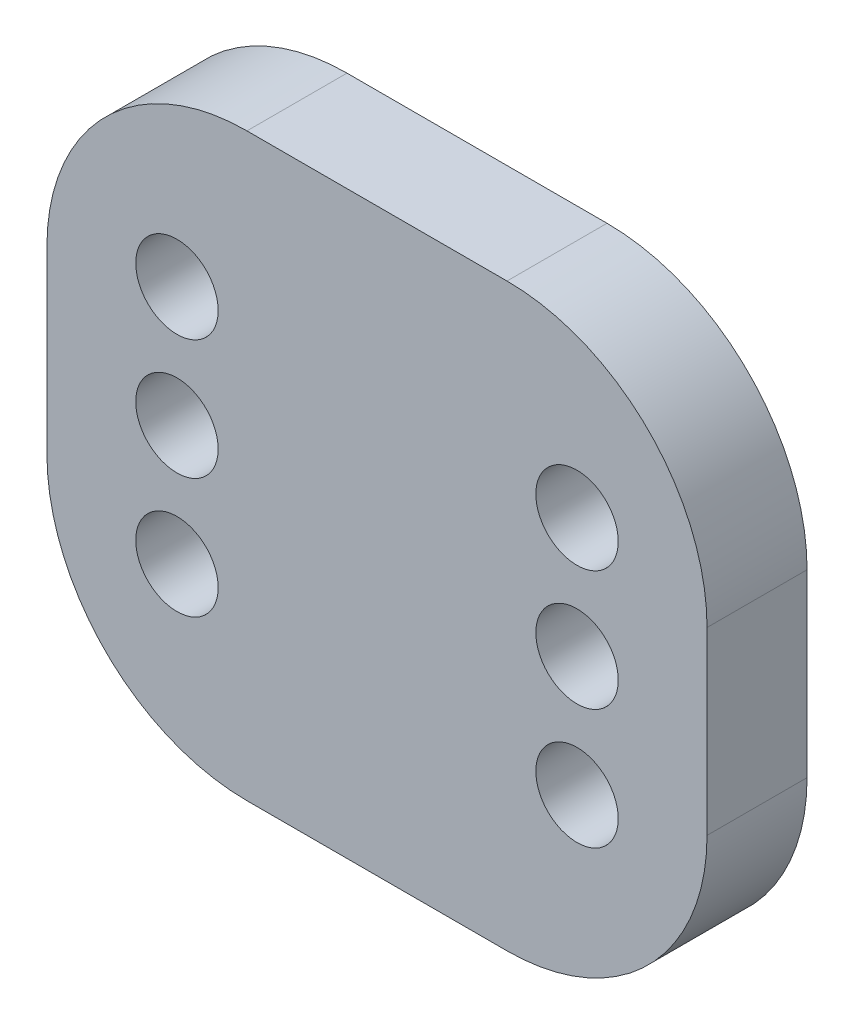
ISO-10303-21;
HEADER;
FILE_DESCRIPTION(('STEP AP214'),'2;1');
FILE_NAME('part.step','',(''),(''),'','','');
FILE_SCHEMA(('AUTOMOTIVE_DESIGN { 1 0 10303 214 1 1 1 1 }'));
ENDSEC;
DATA;
#1=APPLICATION_CONTEXT('core data for automotive mechanical design processes');
#2=APPLICATION_PROTOCOL_DEFINITION('international standard','automotive_design',2000,#1);
#3=PRODUCT_CONTEXT('',#1,'mechanical');
#4=PRODUCT('Part','Part','',(#3));
#5=PRODUCT_RELATED_PRODUCT_CATEGORY('part','',(#4));
#6=PRODUCT_DEFINITION_FORMATION('','',#4);
#7=PRODUCT_DEFINITION_CONTEXT('part definition',#1,'design');
#8=PRODUCT_DEFINITION('design','',#6,#7);
#9=PRODUCT_DEFINITION_SHAPE('','',#8);
#10=(LENGTH_UNIT() NAMED_UNIT(*) SI_UNIT(.MILLI.,.METRE.));
#11=(NAMED_UNIT(*) PLANE_ANGLE_UNIT() SI_UNIT($,.RADIAN.));
#12=(NAMED_UNIT(*) SI_UNIT($,.STERADIAN.) SOLID_ANGLE_UNIT());
#13=UNCERTAINTY_MEASURE_WITH_UNIT(LENGTH_MEASURE(1.E-05),#10,'distance_accuracy_value','');
#14=(GEOMETRIC_REPRESENTATION_CONTEXT(3) GLOBAL_UNCERTAINTY_ASSIGNED_CONTEXT((#13)) GLOBAL_UNIT_ASSIGNED_CONTEXT((#10,
#11,#12)) REPRESENTATION_CONTEXT('',''));
#15=CARTESIAN_POINT('',(0.,0.,0.));
#16=DIRECTION('',(0.,0.,1.));
#17=DIRECTION('',(1.,0.,0.));
#18=AXIS2_PLACEMENT_3D('',#15,#16,#17);
#19=CARTESIAN_POINT('',(0.,0.,6.35));
#20=DIRECTION('',(0.,0.,1.));
#21=DIRECTION('',(1.,0.,0.));
#22=AXIS2_PLACEMENT_3D('',#19,#20,#21);
#23=PLANE('',#22);
#24=CARTESIAN_POINT('',(-12.7,-7.62,6.35));
#25=DIRECTION('',(0.,0.,1.));
#26=DIRECTION('',(1.,0.,0.));
#27=AXIS2_PLACEMENT_3D('',#24,#25,#26);
#28=CIRCLE('',#27,2.6162);
#29=CARTESIAN_POINT('',(-10.0838,-7.62,6.35));
#30=VERTEX_POINT('',#29);
#31=EDGE_CURVE('E201',#30,#30,#28,.T.);
#32=ORIENTED_EDGE('',*,*,#31,.F.);
#33=EDGE_LOOP('',(#32));
#34=FACE_BOUND('',#33,.T.);
#35=CARTESIAN_POINT('',(-12.7,7.62,6.35));
#36=DIRECTION('',(0.,0.,1.));
#37=DIRECTION('',(1.,0.,0.));
#38=AXIS2_PLACEMENT_3D('',#35,#36,#37);
#39=CIRCLE('',#38,2.6162);
#40=CARTESIAN_POINT('',(-10.0838,7.62,6.35));
#41=VERTEX_POINT('',#40);
#42=EDGE_CURVE('E189',#41,#41,#39,.T.);
#43=ORIENTED_EDGE('',*,*,#42,.F.);
#44=EDGE_LOOP('',(#43));
#45=FACE_BOUND('',#44,.T.);
#46=CARTESIAN_POINT('',(-12.7,0.,6.35));
#47=DIRECTION('',(0.,0.,1.));
#48=DIRECTION('',(1.,0.,0.));
#49=AXIS2_PLACEMENT_3D('',#46,#47,#48);
#50=CIRCLE('',#49,2.6162);
#51=CARTESIAN_POINT('',(-10.0838,0.,6.35));
#52=VERTEX_POINT('',#51);
#53=EDGE_CURVE('E172',#52,#52,#50,.T.);
#54=ORIENTED_EDGE('',*,*,#53,.F.);
#55=EDGE_LOOP('',(#54));
#56=FACE_BOUND('',#55,.T.);
#57=DIRECTION('',(0.,-1.,0.));
#58=VECTOR('',#57,1.);
#59=CARTESIAN_POINT('',(-20.955,18.415,6.35));
#60=LINE('',#59,#58);
#61=CARTESIAN_POINT('',(-20.955,5.715,6.35));
#62=VERTEX_POINT('',#61);
#63=CARTESIAN_POINT('',(-20.955,-5.715,6.35));
#64=VERTEX_POINT('',#63);
#65=EDGE_CURVE('E179',#62,#64,#60,.T.);
#66=ORIENTED_EDGE('',*,*,#65,.T.);
#67=CARTESIAN_POINT('',(-8.255,-5.715,6.35));
#68=DIRECTION('',(0.,0.,1.));
#69=DIRECTION('',(1.,0.,0.));
#70=AXIS2_PLACEMENT_3D('',#67,#68,#69);
#71=CIRCLE('',#70,12.7);
#72=CARTESIAN_POINT('',(-8.255,-18.415,6.35));
#73=VERTEX_POINT('',#72);
#74=EDGE_CURVE('E156',#64,#73,#71,.T.);
#75=ORIENTED_EDGE('',*,*,#74,.T.);
#76=DIRECTION('',(1.,0.,0.));
#77=VECTOR('',#76,1.);
#78=CARTESIAN_POINT('',(-20.955,-18.415,6.35));
#79=LINE('',#78,#77);
#80=CARTESIAN_POINT('',(8.25500000000001,-18.415,6.35));
#81=VERTEX_POINT('',#80);
#82=EDGE_CURVE('E127',#73,#81,#79,.T.);
#83=ORIENTED_EDGE('',*,*,#82,.T.);
#84=CARTESIAN_POINT('',(8.25500000000001,-5.715,6.35));
#85=DIRECTION('',(0.,0.,1.));
#86=DIRECTION('',(1.,0.,0.));
#87=AXIS2_PLACEMENT_3D('',#84,#85,#86);
#88=CIRCLE('',#87,12.7);
#89=CARTESIAN_POINT('',(20.955,-5.71499999999999,6.35));
#90=VERTEX_POINT('',#89);
#91=EDGE_CURVE('E154',#81,#90,#88,.T.);
#92=ORIENTED_EDGE('',*,*,#91,.T.);
#93=DIRECTION('',(0.,1.,0.));
#94=VECTOR('',#93,1.);
#95=CARTESIAN_POINT('',(20.955,18.415,6.35));
#96=LINE('',#95,#94);
#97=CARTESIAN_POINT('',(20.955,5.715,6.35));
#98=VERTEX_POINT('',#97);
#99=EDGE_CURVE('E134',#90,#98,#96,.T.);
#100=ORIENTED_EDGE('',*,*,#99,.T.);
#101=CARTESIAN_POINT('',(8.25500000000001,5.715,6.35));
#102=DIRECTION('',(0.,0.,1.));
#103=DIRECTION('',(1.,0.,0.));
#104=AXIS2_PLACEMENT_3D('',#101,#102,#103);
#105=CIRCLE('',#104,12.7);
#106=CARTESIAN_POINT('',(8.25500000000001,18.415,6.35));
#107=VERTEX_POINT('',#106);
#108=EDGE_CURVE('E62',#98,#107,#105,.T.);
#109=ORIENTED_EDGE('',*,*,#108,.T.);
#110=DIRECTION('',(-1.,0.,0.));
#111=VECTOR('',#110,1.);
#112=CARTESIAN_POINT('',(-20.955,18.415,6.35));
#113=LINE('',#112,#111);
#114=CARTESIAN_POINT('',(-8.255,18.415,6.35));
#115=VERTEX_POINT('',#114);
#116=EDGE_CURVE('E137',#107,#115,#113,.T.);
#117=ORIENTED_EDGE('',*,*,#116,.T.);
#118=CARTESIAN_POINT('',(-8.255,5.715,6.35));
#119=DIRECTION('',(0.,0.,1.));
#120=DIRECTION('',(1.,0.,0.));
#121=AXIS2_PLACEMENT_3D('',#118,#119,#120);
#122=CIRCLE('',#121,12.7);
#123=EDGE_CURVE('E151',#115,#62,#122,.T.);
#124=ORIENTED_EDGE('',*,*,#123,.T.);
#125=EDGE_LOOP('',(#66,#75,#83,#92,#100,#109,#117,#124));
#126=FACE_BOUND('',#125,.T.);
#127=CARTESIAN_POINT('',(12.7,0.,6.35));
#128=DIRECTION('',(0.,0.,1.));
#129=DIRECTION('',(1.,0.,0.));
#130=AXIS2_PLACEMENT_3D('',#127,#128,#129);
#131=CIRCLE('',#130,2.6162);
#132=CARTESIAN_POINT('',(15.3162,0.,6.35));
#133=VERTEX_POINT('',#132);
#134=EDGE_CURVE('E184',#133,#133,#131,.T.);
#135=ORIENTED_EDGE('',*,*,#134,.F.);
#136=EDGE_LOOP('',(#135));
#137=FACE_BOUND('',#136,.T.);
#138=CARTESIAN_POINT('',(12.7,7.62,6.35));
#139=DIRECTION('',(0.,0.,1.));
#140=DIRECTION('',(1.,0.,0.));
#141=AXIS2_PLACEMENT_3D('',#138,#139,#140);
#142=CIRCLE('',#141,2.6162);
#143=CARTESIAN_POINT('',(15.3162,7.62,6.35));
#144=VERTEX_POINT('',#143);
#145=EDGE_CURVE('E195',#144,#144,#142,.T.);
#146=ORIENTED_EDGE('',*,*,#145,.F.);
#147=EDGE_LOOP('',(#146));
#148=FACE_BOUND('',#147,.T.);
#149=CARTESIAN_POINT('',(12.7,-7.62,6.35));
#150=DIRECTION('',(0.,0.,1.));
#151=DIRECTION('',(1.,0.,0.));
#152=AXIS2_PLACEMENT_3D('',#149,#150,#151);
#153=CIRCLE('',#152,2.6162);
#154=CARTESIAN_POINT('',(15.3162,-7.62,6.35));
#155=VERTEX_POINT('',#154);
#156=EDGE_CURVE('E207',#155,#155,#153,.T.);
#157=ORIENTED_EDGE('',*,*,#156,.F.);
#158=EDGE_LOOP('',(#157));
#159=FACE_BOUND('',#158,.T.);
#160=ADVANCED_FACE('F41',(#34,#45,#56,#126,#137,#148,#159),#23,.T.);
#161=CARTESIAN_POINT('',(0.,0.,0.));
#162=DIRECTION('',(0.,0.,1.));
#163=DIRECTION('',(1.,0.,0.));
#164=AXIS2_PLACEMENT_3D('',#161,#162,#163);
#165=PLANE('',#164);
#166=DIRECTION('',(1.,0.,0.));
#167=VECTOR('',#166,1.);
#168=CARTESIAN_POINT('',(-20.955,-18.415,0.));
#169=LINE('',#168,#167);
#170=CARTESIAN_POINT('',(-8.255,-18.415,0.));
#171=VERTEX_POINT('',#170);
#172=CARTESIAN_POINT('',(8.25500000000001,-18.415,0.));
#173=VERTEX_POINT('',#172);
#174=EDGE_CURVE('E124',#171,#173,#169,.T.);
#175=ORIENTED_EDGE('',*,*,#174,.F.);
#176=CARTESIAN_POINT('',(-8.255,-5.715,0.));
#177=DIRECTION('',(0.,0.,1.));
#178=DIRECTION('',(1.,0.,0.));
#179=AXIS2_PLACEMENT_3D('',#176,#177,#178);
#180=CIRCLE('',#179,12.7);
#181=CARTESIAN_POINT('',(-20.955,-5.715,0.));
#182=VERTEX_POINT('',#181);
#183=EDGE_CURVE('E107',#171,#182,#180,.F.);
#184=ORIENTED_EDGE('',*,*,#183,.T.);
#185=DIRECTION('',(0.,-1.,0.));
#186=VECTOR('',#185,1.);
#187=CARTESIAN_POINT('',(-20.955,18.415,0.));
#188=LINE('',#187,#186);
#189=CARTESIAN_POINT('',(-20.955,5.715,0.));
#190=VERTEX_POINT('',#189);
#191=EDGE_CURVE('E135',#190,#182,#188,.T.);
#192=ORIENTED_EDGE('',*,*,#191,.F.);
#193=CARTESIAN_POINT('',(-8.255,5.715,0.));
#194=DIRECTION('',(0.,0.,1.));
#195=DIRECTION('',(1.,0.,0.));
#196=AXIS2_PLACEMENT_3D('',#193,#194,#195);
#197=CIRCLE('',#196,12.7);
#198=CARTESIAN_POINT('',(-8.255,18.415,0.));
#199=VERTEX_POINT('',#198);
#200=EDGE_CURVE('E128',#190,#199,#197,.F.);
#201=ORIENTED_EDGE('',*,*,#200,.T.);
#202=DIRECTION('',(-1.,0.,0.));
#203=VECTOR('',#202,1.);
#204=CARTESIAN_POINT('',(-20.955,18.415,0.));
#205=LINE('',#204,#203);
#206=CARTESIAN_POINT('',(8.25500000000001,18.415,0.));
#207=VERTEX_POINT('',#206);
#208=EDGE_CURVE('E139',#207,#199,#205,.T.);
#209=ORIENTED_EDGE('',*,*,#208,.F.);
#210=CARTESIAN_POINT('',(8.25500000000001,5.715,0.));
#211=DIRECTION('',(0.,0.,1.));
#212=DIRECTION('',(1.,0.,0.));
#213=AXIS2_PLACEMENT_3D('',#210,#211,#212);
#214=CIRCLE('',#213,12.7);
#215=CARTESIAN_POINT('',(20.955,5.715,0.));
#216=VERTEX_POINT('',#215);
#217=EDGE_CURVE('E145',#207,#216,#214,.F.);
#218=ORIENTED_EDGE('',*,*,#217,.T.);
#219=DIRECTION('',(0.,1.,0.));
#220=VECTOR('',#219,1.);
#221=CARTESIAN_POINT('',(20.955,18.415,0.));
#222=LINE('',#221,#220);
#223=CARTESIAN_POINT('',(20.955,-5.71499999999999,0.));
#224=VERTEX_POINT('',#223);
#225=EDGE_CURVE('E167',#224,#216,#222,.T.);
#226=ORIENTED_EDGE('',*,*,#225,.F.);
#227=CARTESIAN_POINT('',(8.25500000000001,-5.715,0.));
#228=DIRECTION('',(0.,0.,1.));
#229=DIRECTION('',(1.,0.,0.));
#230=AXIS2_PLACEMENT_3D('',#227,#228,#229);
#231=CIRCLE('',#230,12.7);
#232=EDGE_CURVE('E118',#224,#173,#231,.F.);
#233=ORIENTED_EDGE('',*,*,#232,.T.);
#234=EDGE_LOOP('',(#175,#184,#192,#201,#209,#218,#226,#233));
#235=FACE_BOUND('',#234,.T.);
#236=CARTESIAN_POINT('',(-12.7,0.,0.));
#237=DIRECTION('',(0.,0.,1.));
#238=DIRECTION('',(1.,0.,0.));
#239=AXIS2_PLACEMENT_3D('',#236,#237,#238);
#240=CIRCLE('',#239,2.6162);
#241=CARTESIAN_POINT('',(-10.0838,0.,0.));
#242=VERTEX_POINT('',#241);
#243=EDGE_CURVE('E175',#242,#242,#240,.T.);
#244=ORIENTED_EDGE('',*,*,#243,.T.);
#245=EDGE_LOOP('',(#244));
#246=FACE_BOUND('',#245,.T.);
#247=CARTESIAN_POINT('',(12.7,0.,0.));
#248=DIRECTION('',(0.,0.,1.));
#249=DIRECTION('',(1.,0.,0.));
#250=AXIS2_PLACEMENT_3D('',#247,#248,#249);
#251=CIRCLE('',#250,2.6162);
#252=CARTESIAN_POINT('',(15.3162,0.,0.));
#253=VERTEX_POINT('',#252);
#254=EDGE_CURVE('E186',#253,#253,#251,.T.);
#255=ORIENTED_EDGE('',*,*,#254,.T.);
#256=EDGE_LOOP('',(#255));
#257=FACE_BOUND('',#256,.T.);
#258=CARTESIAN_POINT('',(-12.7,7.62,0.));
#259=DIRECTION('',(0.,0.,1.));
#260=DIRECTION('',(1.,0.,0.));
#261=AXIS2_PLACEMENT_3D('',#258,#259,#260);
#262=CIRCLE('',#261,2.6162);
#263=CARTESIAN_POINT('',(-10.0838,7.62,0.));
#264=VERTEX_POINT('',#263);
#265=EDGE_CURVE('E192',#264,#264,#262,.T.);
#266=ORIENTED_EDGE('',*,*,#265,.T.);
#267=EDGE_LOOP('',(#266));
#268=FACE_BOUND('',#267,.T.);
#269=CARTESIAN_POINT('',(12.7,7.62,0.));
#270=DIRECTION('',(0.,0.,1.));
#271=DIRECTION('',(1.,0.,0.));
#272=AXIS2_PLACEMENT_3D('',#269,#270,#271);
#273=CIRCLE('',#272,2.6162);
#274=CARTESIAN_POINT('',(15.3162,7.62,0.));
#275=VERTEX_POINT('',#274);
#276=EDGE_CURVE('E198',#275,#275,#273,.T.);
#277=ORIENTED_EDGE('',*,*,#276,.T.);
#278=EDGE_LOOP('',(#277));
#279=FACE_BOUND('',#278,.T.);
#280=CARTESIAN_POINT('',(-12.7,-7.62,0.));
#281=DIRECTION('',(0.,0.,1.));
#282=DIRECTION('',(1.,0.,0.));
#283=AXIS2_PLACEMENT_3D('',#280,#281,#282);
#284=CIRCLE('',#283,2.6162);
#285=CARTESIAN_POINT('',(-10.0838,-7.62,0.));
#286=VERTEX_POINT('',#285);
#287=EDGE_CURVE('E204',#286,#286,#284,.T.);
#288=ORIENTED_EDGE('',*,*,#287,.T.);
#289=EDGE_LOOP('',(#288));
#290=FACE_BOUND('',#289,.T.);
#291=CARTESIAN_POINT('',(12.7,-7.62,0.));
#292=DIRECTION('',(0.,0.,1.));
#293=DIRECTION('',(1.,0.,0.));
#294=AXIS2_PLACEMENT_3D('',#291,#292,#293);
#295=CIRCLE('',#294,2.6162);
#296=CARTESIAN_POINT('',(15.3162,-7.62,0.));
#297=VERTEX_POINT('',#296);
#298=EDGE_CURVE('E210',#297,#297,#295,.T.);
#299=ORIENTED_EDGE('',*,*,#298,.T.);
#300=EDGE_LOOP('',(#299));
#301=FACE_BOUND('',#300,.T.);
#302=ADVANCED_FACE('F131',(#235,#246,#257,#268,#279,#290,#301),#165,.F.);
#303=CARTESIAN_POINT('',(20.955,18.415,6.35));
#304=DIRECTION('',(-1.,0.,0.));
#305=DIRECTION('',(0.,-1.,0.));
#306=AXIS2_PLACEMENT_3D('',#303,#304,#305);
#307=PLANE('',#306);
#308=ORIENTED_EDGE('',*,*,#99,.F.);
#309=DIRECTION('',(0.,0.,-1.));
#310=VECTOR('',#309,1.);
#311=CARTESIAN_POINT('',(20.955,-5.71499999999999,6.35));
#312=LINE('',#311,#310);
#313=EDGE_CURVE('E160',#90,#224,#312,.T.);
#314=ORIENTED_EDGE('',*,*,#313,.T.);
#315=ORIENTED_EDGE('',*,*,#225,.T.);
#316=DIRECTION('',(0.,0.,-1.));
#317=VECTOR('',#316,1.);
#318=CARTESIAN_POINT('',(20.955,5.715,6.35));
#319=LINE('',#318,#317);
#320=EDGE_CURVE('E158',#216,#98,#319,.F.);
#321=ORIENTED_EDGE('',*,*,#320,.T.);
#322=EDGE_LOOP('',(#308,#314,#315,#321));
#323=FACE_BOUND('',#322,.T.);
#324=ADVANCED_FACE('F166',(#323),#307,.F.);
#325=CARTESIAN_POINT('',(-20.955,18.415,6.35));
#326=DIRECTION('',(0.,-1.,0.));
#327=DIRECTION('',(0.,0.,-1.));
#328=AXIS2_PLACEMENT_3D('',#325,#326,#327);
#329=PLANE('',#328);
#330=ORIENTED_EDGE('',*,*,#116,.F.);
#331=DIRECTION('',(0.,0.,-1.));
#332=VECTOR('',#331,1.);
#333=CARTESIAN_POINT('',(8.25500000000001,18.415,6.35));
#334=LINE('',#333,#332);
#335=EDGE_CURVE('E11',#107,#207,#334,.T.);
#336=ORIENTED_EDGE('',*,*,#335,.T.);
#337=ORIENTED_EDGE('',*,*,#208,.T.);
#338=DIRECTION('',(0.,0.,-1.));
#339=VECTOR('',#338,1.);
#340=CARTESIAN_POINT('',(-8.255,18.415,6.35));
#341=LINE('',#340,#339);
#342=EDGE_CURVE('E49',#199,#115,#341,.F.);
#343=ORIENTED_EDGE('',*,*,#342,.T.);
#344=EDGE_LOOP('',(#330,#336,#337,#343));
#345=FACE_BOUND('',#344,.T.);
#346=ADVANCED_FACE('F238',(#345),#329,.F.);
#347=CARTESIAN_POINT('',(-20.955,18.415,6.35));
#348=DIRECTION('',(1.,0.,0.));
#349=DIRECTION('',(0.,1.,0.));
#350=AXIS2_PLACEMENT_3D('',#347,#348,#349);
#351=PLANE('',#350);
#352=ORIENTED_EDGE('',*,*,#191,.T.);
#353=DIRECTION('',(0.,0.,-1.));
#354=VECTOR('',#353,1.);
#355=CARTESIAN_POINT('',(-20.955,-5.715,6.35));
#356=LINE('',#355,#354);
#357=EDGE_CURVE('E112',#182,#64,#356,.F.);
#358=ORIENTED_EDGE('',*,*,#357,.T.);
#359=ORIENTED_EDGE('',*,*,#65,.F.);
#360=DIRECTION('',(0.,0.,-1.));
#361=VECTOR('',#360,1.);
#362=CARTESIAN_POINT('',(-20.955,5.715,6.35));
#363=LINE('',#362,#361);
#364=EDGE_CURVE('E117',#62,#190,#363,.T.);
#365=ORIENTED_EDGE('',*,*,#364,.T.);
#366=EDGE_LOOP('',(#352,#358,#359,#365));
#367=FACE_BOUND('',#366,.T.);
#368=ADVANCED_FACE('F235',(#367),#351,.F.);
#369=CARTESIAN_POINT('',(-20.955,-18.415,6.35));
#370=DIRECTION('',(0.,1.,0.));
#371=DIRECTION('',(0.,0.,1.));
#372=AXIS2_PLACEMENT_3D('',#369,#370,#371);
#373=PLANE('',#372);
#374=ORIENTED_EDGE('',*,*,#82,.F.);
#375=DIRECTION('',(0.,0.,-1.));
#376=VECTOR('',#375,1.);
#377=CARTESIAN_POINT('',(-8.255,-18.415,6.35));
#378=LINE('',#377,#376);
#379=EDGE_CURVE('E111',#73,#171,#378,.T.);
#380=ORIENTED_EDGE('',*,*,#379,.T.);
#381=ORIENTED_EDGE('',*,*,#174,.T.);
#382=DIRECTION('',(0.,0.,-1.));
#383=VECTOR('',#382,1.);
#384=CARTESIAN_POINT('',(8.25500000000001,-18.415,6.35));
#385=LINE('',#384,#383);
#386=EDGE_CURVE('E129',#173,#81,#385,.F.);
#387=ORIENTED_EDGE('',*,*,#386,.T.);
#388=EDGE_LOOP('',(#374,#380,#381,#387));
#389=FACE_BOUND('',#388,.T.);
#390=ADVANCED_FACE('F123',(#389),#373,.F.);
#391=CARTESIAN_POINT('',(-12.7,0.,6.35));
#392=DIRECTION('',(0.,0.,-1.));
#393=DIRECTION('',(-1.,0.,0.));
#394=AXIS2_PLACEMENT_3D('',#391,#392,#393);
#395=CYLINDRICAL_SURFACE('',#394,2.6162);
#396=ORIENTED_EDGE('',*,*,#53,.T.);
#397=EDGE_LOOP('',(#396));
#398=FACE_BOUND('',#397,.T.);
#399=ORIENTED_EDGE('',*,*,#243,.F.);
#400=EDGE_LOOP('',(#399));
#401=FACE_BOUND('',#400,.T.);
#402=ADVANCED_FACE('F230',(#398,#401),#395,.F.);
#403=CARTESIAN_POINT('',(12.7,0.,6.35));
#404=DIRECTION('',(0.,0.,-1.));
#405=DIRECTION('',(-1.,0.,0.));
#406=AXIS2_PLACEMENT_3D('',#403,#404,#405);
#407=CYLINDRICAL_SURFACE('',#406,2.6162);
#408=ORIENTED_EDGE('',*,*,#134,.T.);
#409=EDGE_LOOP('',(#408));
#410=FACE_BOUND('',#409,.T.);
#411=ORIENTED_EDGE('',*,*,#254,.F.);
#412=EDGE_LOOP('',(#411));
#413=FACE_BOUND('',#412,.T.);
#414=ADVANCED_FACE('F284',(#410,#413),#407,.F.);
#415=CARTESIAN_POINT('',(-12.7,7.62,6.35));
#416=DIRECTION('',(0.,0.,-1.));
#417=DIRECTION('',(-1.,0.,0.));
#418=AXIS2_PLACEMENT_3D('',#415,#416,#417);
#419=CYLINDRICAL_SURFACE('',#418,2.6162);
#420=ORIENTED_EDGE('',*,*,#42,.T.);
#421=EDGE_LOOP('',(#420));
#422=FACE_BOUND('',#421,.T.);
#423=ORIENTED_EDGE('',*,*,#265,.F.);
#424=EDGE_LOOP('',(#423));
#425=FACE_BOUND('',#424,.T.);
#426=ADVANCED_FACE('F268',(#422,#425),#419,.F.);
#427=CARTESIAN_POINT('',(12.7,7.62,6.35));
#428=DIRECTION('',(0.,0.,-1.));
#429=DIRECTION('',(-1.,0.,0.));
#430=AXIS2_PLACEMENT_3D('',#427,#428,#429);
#431=CYLINDRICAL_SURFACE('',#430,2.6162);
#432=ORIENTED_EDGE('',*,*,#145,.T.);
#433=EDGE_LOOP('',(#432));
#434=FACE_BOUND('',#433,.T.);
#435=ORIENTED_EDGE('',*,*,#276,.F.);
#436=EDGE_LOOP('',(#435));
#437=FACE_BOUND('',#436,.T.);
#438=ADVANCED_FACE('F264',(#434,#437),#431,.F.);
#439=CARTESIAN_POINT('',(-12.7,-7.62,6.35));
#440=DIRECTION('',(0.,0.,-1.));
#441=DIRECTION('',(-1.,0.,0.));
#442=AXIS2_PLACEMENT_3D('',#439,#440,#441);
#443=CYLINDRICAL_SURFACE('',#442,2.6162);
#444=ORIENTED_EDGE('',*,*,#31,.T.);
#445=EDGE_LOOP('',(#444));
#446=FACE_BOUND('',#445,.T.);
#447=ORIENTED_EDGE('',*,*,#287,.F.);
#448=EDGE_LOOP('',(#447));
#449=FACE_BOUND('',#448,.T.);
#450=ADVANCED_FACE('F267',(#446,#449),#443,.F.);
#451=CARTESIAN_POINT('',(12.7,-7.62,6.35));
#452=DIRECTION('',(0.,0.,-1.));
#453=DIRECTION('',(-1.,0.,0.));
#454=AXIS2_PLACEMENT_3D('',#451,#452,#453);
#455=CYLINDRICAL_SURFACE('',#454,2.6162);
#456=ORIENTED_EDGE('',*,*,#156,.T.);
#457=EDGE_LOOP('',(#456));
#458=FACE_BOUND('',#457,.T.);
#459=ORIENTED_EDGE('',*,*,#298,.F.);
#460=EDGE_LOOP('',(#459));
#461=FACE_BOUND('',#460,.T.);
#462=ADVANCED_FACE('F216',(#458,#461),#455,.F.);
#463=CARTESIAN_POINT('',(-8.255,-5.715,6.35));
#464=DIRECTION('',(0.,0.,-1.));
#465=DIRECTION('',(-1.,0.,0.));
#466=AXIS2_PLACEMENT_3D('',#463,#464,#465);
#467=CYLINDRICAL_SURFACE('',#466,12.7);
#468=ORIENTED_EDGE('',*,*,#74,.F.);
#469=ORIENTED_EDGE('',*,*,#357,.F.);
#470=ORIENTED_EDGE('',*,*,#183,.F.);
#471=ORIENTED_EDGE('',*,*,#379,.F.);
#472=EDGE_LOOP('',(#468,#469,#470,#471));
#473=FACE_BOUND('',#472,.T.);
#474=ADVANCED_FACE('F110',(#473),#467,.T.);
#475=CARTESIAN_POINT('',(8.25500000000001,-5.715,6.35));
#476=DIRECTION('',(0.,0.,-1.));
#477=DIRECTION('',(-1.,0.,0.));
#478=AXIS2_PLACEMENT_3D('',#475,#476,#477);
#479=CYLINDRICAL_SURFACE('',#478,12.7);
#480=ORIENTED_EDGE('',*,*,#91,.F.);
#481=ORIENTED_EDGE('',*,*,#386,.F.);
#482=ORIENTED_EDGE('',*,*,#232,.F.);
#483=ORIENTED_EDGE('',*,*,#313,.F.);
#484=EDGE_LOOP('',(#480,#481,#482,#483));
#485=FACE_BOUND('',#484,.T.);
#486=ADVANCED_FACE('F246',(#485),#479,.T.);
#487=CARTESIAN_POINT('',(8.25500000000001,5.715,6.35));
#488=DIRECTION('',(0.,0.,-1.));
#489=DIRECTION('',(-1.,0.,0.));
#490=AXIS2_PLACEMENT_3D('',#487,#488,#489);
#491=CYLINDRICAL_SURFACE('',#490,12.7);
#492=ORIENTED_EDGE('',*,*,#108,.F.);
#493=ORIENTED_EDGE('',*,*,#320,.F.);
#494=ORIENTED_EDGE('',*,*,#217,.F.);
#495=ORIENTED_EDGE('',*,*,#335,.F.);
#496=EDGE_LOOP('',(#492,#493,#494,#495));
#497=FACE_BOUND('',#496,.T.);
#498=ADVANCED_FACE('F248',(#497),#491,.T.);
#499=CARTESIAN_POINT('',(-8.255,5.715,6.35));
#500=DIRECTION('',(0.,0.,-1.));
#501=DIRECTION('',(-1.,0.,0.));
#502=AXIS2_PLACEMENT_3D('',#499,#500,#501);
#503=CYLINDRICAL_SURFACE('',#502,12.7);
#504=ORIENTED_EDGE('',*,*,#123,.F.);
#505=ORIENTED_EDGE('',*,*,#342,.F.);
#506=ORIENTED_EDGE('',*,*,#200,.F.);
#507=ORIENTED_EDGE('',*,*,#364,.F.);
#508=EDGE_LOOP('',(#504,#505,#506,#507));
#509=FACE_BOUND('',#508,.T.);
#510=ADVANCED_FACE('F43',(#509),#503,.T.);
#511=CLOSED_SHELL('',(#160,#302,#324,#346,#368,#390,#402,#414,#426,#438,#450,#462,#474,#486,
#498,#510));
#512=MANIFOLD_SOLID_BREP('B2',#511);
#513=ADVANCED_BREP_SHAPE_REPRESENTATION('',(#18,#512),#14);
#514=SHAPE_DEFINITION_REPRESENTATION(#9,#513);
ENDSEC;
END-ISO-10303-21;
